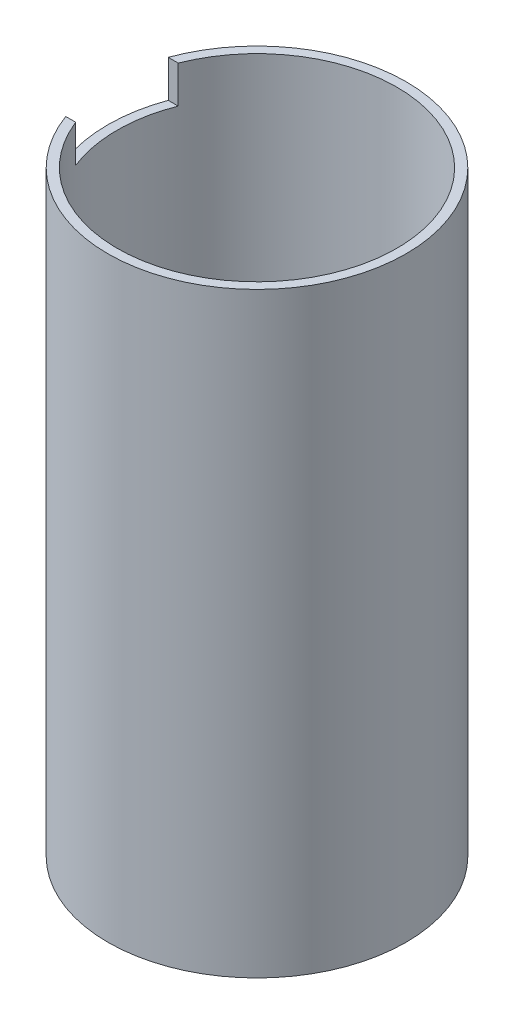
ISO-10303-21;
HEADER;
FILE_DESCRIPTION(('STEP AP214'),'2;1');
FILE_NAME('part.step','',(''),(''),'','','');
FILE_SCHEMA(('AUTOMOTIVE_DESIGN { 1 0 10303 214 1 1 1 1 }'));
ENDSEC;
DATA;
#1=APPLICATION_CONTEXT('core data for automotive mechanical design processes');
#2=APPLICATION_PROTOCOL_DEFINITION('international standard','automotive_design',2000,#1);
#3=PRODUCT_CONTEXT('',#1,'mechanical');
#4=PRODUCT('Part','Part','',(#3));
#5=PRODUCT_RELATED_PRODUCT_CATEGORY('part','',(#4));
#6=PRODUCT_DEFINITION_FORMATION('','',#4);
#7=PRODUCT_DEFINITION_CONTEXT('part definition',#1,'design');
#8=PRODUCT_DEFINITION('design','',#6,#7);
#9=PRODUCT_DEFINITION_SHAPE('','',#8);
#10=(LENGTH_UNIT() NAMED_UNIT(*) SI_UNIT(.MILLI.,.METRE.));
#11=(NAMED_UNIT(*) PLANE_ANGLE_UNIT() SI_UNIT($,.RADIAN.));
#12=(NAMED_UNIT(*) SI_UNIT($,.STERADIAN.) SOLID_ANGLE_UNIT());
#13=UNCERTAINTY_MEASURE_WITH_UNIT(LENGTH_MEASURE(1.E-05),#10,'distance_accuracy_value','');
#14=(GEOMETRIC_REPRESENTATION_CONTEXT(3) GLOBAL_UNCERTAINTY_ASSIGNED_CONTEXT((#13)) GLOBAL_UNIT_ASSIGNED_CONTEXT((#10,
#11,#12)) REPRESENTATION_CONTEXT('',''));
#15=CARTESIAN_POINT('',(0.,0.,0.));
#16=DIRECTION('',(0.,0.,1.));
#17=DIRECTION('',(1.,0.,0.));
#18=AXIS2_PLACEMENT_3D('',#15,#16,#17);
#19=CARTESIAN_POINT('',(0.,64.,0.));
#20=DIRECTION('',(0.,1.,0.));
#21=DIRECTION('',(0.,0.,1.));
#22=AXIS2_PLACEMENT_3D('',#19,#20,#21);
#23=PLANE('',#22);
#24=DIRECTION('',(1.,0.,0.));
#25=VECTOR('',#24,1.);
#26=CARTESIAN_POINT('',(0.,64.,5.5));
#27=LINE('',#26,#25);
#28=CARTESIAN_POINT('',(-15.0249792013167,64.,5.5));
#29=VERTEX_POINT('',#28);
#30=CARTESIAN_POINT('',(-13.9552857369529,64.,5.5));
#31=VERTEX_POINT('',#30);
#32=EDGE_CURVE('E184',#29,#31,#27,.T.);
#33=ORIENTED_EDGE('',*,*,#32,.F.);
#34=CARTESIAN_POINT('',(0.,64.,0.));
#35=DIRECTION('',(0.,1.,0.));
#36=DIRECTION('',(0.,0.,1.));
#37=AXIS2_PLACEMENT_3D('',#34,#35,#36);
#38=CIRCLE('',#37,16.);
#39=CARTESIAN_POINT('',(-15.0249792013167,64.,-5.5));
#40=VERTEX_POINT('',#39);
#41=EDGE_CURVE('E136',#29,#40,#38,.T.);
#42=ORIENTED_EDGE('',*,*,#41,.T.);
#43=DIRECTION('',(-1.,0.,0.));
#44=VECTOR('',#43,1.);
#45=CARTESIAN_POINT('',(-16.8101625802274,64.,-5.5));
#46=LINE('',#45,#44);
#47=CARTESIAN_POINT('',(-13.9552857369529,64.,-5.5));
#48=VERTEX_POINT('',#47);
#49=EDGE_CURVE('E118',#48,#40,#46,.T.);
#50=ORIENTED_EDGE('',*,*,#49,.F.);
#51=CARTESIAN_POINT('',(0.,64.,0.));
#52=DIRECTION('',(0.,1.,0.));
#53=DIRECTION('',(0.,0.,1.));
#54=AXIS2_PLACEMENT_3D('',#51,#52,#53);
#55=CIRCLE('',#54,15.);
#56=EDGE_CURVE('E137',#31,#48,#55,.T.);
#57=ORIENTED_EDGE('',*,*,#56,.F.);
#58=EDGE_LOOP('',(#33,#42,#50,#57));
#59=FACE_BOUND('',#58,.T.);
#60=ADVANCED_FACE('F45',(#59),#23,.T.);
#61=CARTESIAN_POINT('',(0.,0.,0.));
#62=DIRECTION('',(0.,1.,0.));
#63=DIRECTION('',(0.,0.,1.));
#64=AXIS2_PLACEMENT_3D('',#61,#62,#63);
#65=PLANE('',#64);
#66=CARTESIAN_POINT('',(0.,0.,0.));
#67=DIRECTION('',(0.,1.,0.));
#68=DIRECTION('',(0.,0.,1.));
#69=AXIS2_PLACEMENT_3D('',#66,#67,#68);
#70=CIRCLE('',#69,15.);
#71=CARTESIAN_POINT('',(-13.9552857369529,0.,5.5));
#72=VERTEX_POINT('',#71);
#73=CARTESIAN_POINT('',(-13.9552857369529,0.,-5.5));
#74=VERTEX_POINT('',#73);
#75=EDGE_CURVE('E128',#72,#74,#70,.T.);
#76=ORIENTED_EDGE('',*,*,#75,.T.);
#77=DIRECTION('',(1.,0.,0.));
#78=VECTOR('',#77,1.);
#79=CARTESIAN_POINT('',(0.,0.,-5.5));
#80=LINE('',#79,#78);
#81=CARTESIAN_POINT('',(-15.0249792013167,0.,-5.5));
#82=VERTEX_POINT('',#81);
#83=EDGE_CURVE('E112',#82,#74,#80,.T.);
#84=ORIENTED_EDGE('',*,*,#83,.F.);
#85=CARTESIAN_POINT('',(0.,0.,0.));
#86=DIRECTION('',(0.,1.,0.));
#87=DIRECTION('',(0.,0.,1.));
#88=AXIS2_PLACEMENT_3D('',#85,#86,#87);
#89=CIRCLE('',#88,16.);
#90=CARTESIAN_POINT('',(-15.0249792013167,0.,5.5));
#91=VERTEX_POINT('',#90);
#92=EDGE_CURVE('E126',#91,#82,#89,.T.);
#93=ORIENTED_EDGE('',*,*,#92,.F.);
#94=DIRECTION('',(-1.,0.,0.));
#95=VECTOR('',#94,1.);
#96=CARTESIAN_POINT('',(-17.0114058037553,0.,5.5));
#97=LINE('',#96,#95);
#98=EDGE_CURVE('E131',#72,#91,#97,.T.);
#99=ORIENTED_EDGE('',*,*,#98,.F.);
#100=EDGE_LOOP('',(#76,#84,#93,#99));
#101=FACE_BOUND('',#100,.T.);
#102=ADVANCED_FACE('F124',(#101),#65,.F.);
#103=CARTESIAN_POINT('',(0.,64.,0.));
#104=DIRECTION('',(0.,-1.,0.));
#105=DIRECTION('',(0.,0.,-1.));
#106=AXIS2_PLACEMENT_3D('',#103,#104,#105);
#107=CYLINDRICAL_SURFACE('',#106,16.);
#108=ORIENTED_EDGE('',*,*,#92,.T.);
#109=DIRECTION('',(0.,-1.,0.));
#110=VECTOR('',#109,1.);
#111=CARTESIAN_POINT('',(-15.0249792013167,64.,-5.5));
#112=LINE('',#111,#110);
#113=CARTESIAN_POINT('',(-15.0249792013167,4.,-5.5));
#114=VERTEX_POINT('',#113);
#115=EDGE_CURVE('E109',#82,#114,#112,.F.);
#116=ORIENTED_EDGE('',*,*,#115,.T.);
#117=CARTESIAN_POINT('',(0.,4.,0.));
#118=DIRECTION('',(0.,1.,0.));
#119=DIRECTION('',(0.,0.,1.));
#120=AXIS2_PLACEMENT_3D('',#117,#118,#119);
#121=CIRCLE('',#120,16.);
#122=CARTESIAN_POINT('',(-15.0249792013167,4.,5.5));
#123=VERTEX_POINT('',#122);
#124=EDGE_CURVE('E197',#114,#123,#121,.T.);
#125=ORIENTED_EDGE('',*,*,#124,.T.);
#126=DIRECTION('',(0.,-1.,0.));
#127=VECTOR('',#126,1.);
#128=CARTESIAN_POINT('',(-15.0249792013167,64.,5.5));
#129=LINE('',#128,#127);
#130=EDGE_CURVE('E119',#123,#91,#129,.T.);
#131=ORIENTED_EDGE('',*,*,#130,.T.);
#132=EDGE_LOOP('',(#108,#116,#125,#131));
#133=FACE_BOUND('',#132,.T.);
#134=ORIENTED_EDGE('',*,*,#41,.F.);
#135=DIRECTION('',(0.,-1.,0.));
#136=VECTOR('',#135,1.);
#137=CARTESIAN_POINT('',(-15.0249792013167,64.,5.5));
#138=LINE('',#137,#136);
#139=CARTESIAN_POINT('',(-15.0249792013167,60.,5.5));
#140=VERTEX_POINT('',#139);
#141=EDGE_CURVE('E171',#29,#140,#138,.T.);
#142=ORIENTED_EDGE('',*,*,#141,.T.);
#143=CARTESIAN_POINT('',(0.,60.,0.));
#144=DIRECTION('',(0.,-1.,0.));
#145=DIRECTION('',(0.,0.,-1.));
#146=AXIS2_PLACEMENT_3D('',#143,#144,#145);
#147=CIRCLE('',#146,16.);
#148=CARTESIAN_POINT('',(-15.0249792013167,60.,-5.5));
#149=VERTEX_POINT('',#148);
#150=EDGE_CURVE('E180',#140,#149,#147,.T.);
#151=ORIENTED_EDGE('',*,*,#150,.T.);
#152=DIRECTION('',(0.,-1.,0.));
#153=VECTOR('',#152,1.);
#154=CARTESIAN_POINT('',(-15.0249792013167,64.,-5.5));
#155=LINE('',#154,#153);
#156=EDGE_CURVE('E174',#149,#40,#155,.F.);
#157=ORIENTED_EDGE('',*,*,#156,.T.);
#158=EDGE_LOOP('',(#134,#142,#151,#157));
#159=FACE_BOUND('',#158,.T.);
#160=ADVANCED_FACE('F47',(#133,#159),#107,.T.);
#161=CARTESIAN_POINT('',(0.,64.,0.));
#162=DIRECTION('',(0.,-1.,0.));
#163=DIRECTION('',(0.,0.,-1.));
#164=AXIS2_PLACEMENT_3D('',#161,#162,#163);
#165=CYLINDRICAL_SURFACE('',#164,15.);
#166=DIRECTION('',(0.,-1.,0.));
#167=VECTOR('',#166,1.);
#168=CARTESIAN_POINT('',(-13.9552857369529,64.,-5.5));
#169=LINE('',#168,#167);
#170=CARTESIAN_POINT('',(-13.9552857369529,4.,-5.5));
#171=VERTEX_POINT('',#170);
#172=EDGE_CURVE('E11',#74,#171,#169,.F.);
#173=ORIENTED_EDGE('',*,*,#172,.F.);
#174=ORIENTED_EDGE('',*,*,#75,.F.);
#175=DIRECTION('',(0.,-1.,0.));
#176=VECTOR('',#175,1.);
#177=CARTESIAN_POINT('',(-13.9552857369529,64.,5.5));
#178=LINE('',#177,#176);
#179=CARTESIAN_POINT('',(-13.9552857369529,4.,5.5));
#180=VERTEX_POINT('',#179);
#181=EDGE_CURVE('E54',#180,#72,#178,.T.);
#182=ORIENTED_EDGE('',*,*,#181,.F.);
#183=CARTESIAN_POINT('',(0.,4.,0.));
#184=DIRECTION('',(0.,1.,0.));
#185=DIRECTION('',(0.,0.,1.));
#186=AXIS2_PLACEMENT_3D('',#183,#184,#185);
#187=CIRCLE('',#186,15.);
#188=EDGE_CURVE('E156',#171,#180,#187,.T.);
#189=ORIENTED_EDGE('',*,*,#188,.F.);
#190=EDGE_LOOP('',(#173,#174,#182,#189));
#191=FACE_BOUND('',#190,.T.);
#192=DIRECTION('',(0.,-1.,0.));
#193=VECTOR('',#192,1.);
#194=CARTESIAN_POINT('',(-13.9552857369529,64.,5.5));
#195=LINE('',#194,#193);
#196=CARTESIAN_POINT('',(-13.9552857369529,60.,5.5));
#197=VERTEX_POINT('',#196);
#198=EDGE_CURVE('E153',#31,#197,#195,.T.);
#199=ORIENTED_EDGE('',*,*,#198,.F.);
#200=ORIENTED_EDGE('',*,*,#56,.T.);
#201=DIRECTION('',(0.,-1.,0.));
#202=VECTOR('',#201,1.);
#203=CARTESIAN_POINT('',(-13.9552857369529,64.,-5.5));
#204=LINE('',#203,#202);
#205=CARTESIAN_POINT('',(-13.9552857369529,60.,-5.5));
#206=VERTEX_POINT('',#205);
#207=EDGE_CURVE('E150',#206,#48,#204,.F.);
#208=ORIENTED_EDGE('',*,*,#207,.F.);
#209=CARTESIAN_POINT('',(0.,60.,0.));
#210=DIRECTION('',(0.,-1.,0.));
#211=DIRECTION('',(0.,0.,-1.));
#212=AXIS2_PLACEMENT_3D('',#209,#210,#211);
#213=CIRCLE('',#212,15.);
#214=EDGE_CURVE('E142',#197,#206,#213,.T.);
#215=ORIENTED_EDGE('',*,*,#214,.F.);
#216=EDGE_LOOP('',(#199,#200,#208,#215));
#217=FACE_BOUND('',#216,.T.);
#218=ADVANCED_FACE('F168',(#191,#217),#165,.F.);
#219=CARTESIAN_POINT('',(0.,60.,5.5));
#220=DIRECTION('',(0.,0.,1.));
#221=DIRECTION('',(1.,0.,0.));
#222=AXIS2_PLACEMENT_3D('',#219,#220,#221);
#223=PLANE('',#222);
#224=ORIENTED_EDGE('',*,*,#32,.T.);
#225=ORIENTED_EDGE('',*,*,#198,.T.);
#226=DIRECTION('',(1.,0.,0.));
#227=VECTOR('',#226,1.);
#228=CARTESIAN_POINT('',(0.,60.,5.5));
#229=LINE('',#228,#227);
#230=EDGE_CURVE('E68',#140,#197,#229,.T.);
#231=ORIENTED_EDGE('',*,*,#230,.F.);
#232=ORIENTED_EDGE('',*,*,#141,.F.);
#233=EDGE_LOOP('',(#224,#225,#231,#232));
#234=FACE_BOUND('',#233,.T.);
#235=ADVANCED_FACE('F222',(#234),#223,.F.);
#236=CARTESIAN_POINT('',(-16.8101625802274,60.,-5.5));
#237=DIRECTION('',(0.,0.,-1.));
#238=DIRECTION('',(-1.,0.,0.));
#239=AXIS2_PLACEMENT_3D('',#236,#237,#238);
#240=PLANE('',#239);
#241=DIRECTION('',(-1.,0.,0.));
#242=VECTOR('',#241,1.);
#243=CARTESIAN_POINT('',(-16.8101625802274,60.,-5.5));
#244=LINE('',#243,#242);
#245=EDGE_CURVE('E187',#206,#149,#244,.T.);
#246=ORIENTED_EDGE('',*,*,#245,.F.);
#247=ORIENTED_EDGE('',*,*,#207,.T.);
#248=ORIENTED_EDGE('',*,*,#49,.T.);
#249=ORIENTED_EDGE('',*,*,#156,.F.);
#250=EDGE_LOOP('',(#246,#247,#248,#249));
#251=FACE_BOUND('',#250,.T.);
#252=ADVANCED_FACE('F223',(#251),#240,.F.);
#253=CARTESIAN_POINT('',(0.,60.,0.));
#254=DIRECTION('',(0.,-1.,0.));
#255=DIRECTION('',(0.,0.,-1.));
#256=AXIS2_PLACEMENT_3D('',#253,#254,#255);
#257=PLANE('',#256);
#258=ORIENTED_EDGE('',*,*,#230,.T.);
#259=ORIENTED_EDGE('',*,*,#214,.T.);
#260=ORIENTED_EDGE('',*,*,#245,.T.);
#261=ORIENTED_EDGE('',*,*,#150,.F.);
#262=EDGE_LOOP('',(#258,#259,#260,#261));
#263=FACE_BOUND('',#262,.T.);
#264=ADVANCED_FACE('F226',(#263),#257,.F.);
#265=CARTESIAN_POINT('',(0.,4.,-5.5));
#266=DIRECTION('',(0.,0.,-1.));
#267=DIRECTION('',(-1.,0.,0.));
#268=AXIS2_PLACEMENT_3D('',#265,#266,#267);
#269=PLANE('',#268);
#270=ORIENTED_EDGE('',*,*,#83,.T.);
#271=ORIENTED_EDGE('',*,*,#172,.T.);
#272=DIRECTION('',(1.,0.,0.));
#273=VECTOR('',#272,1.);
#274=CARTESIAN_POINT('',(0.,4.,-5.5));
#275=LINE('',#274,#273);
#276=EDGE_CURVE('E61',#114,#171,#275,.T.);
#277=ORIENTED_EDGE('',*,*,#276,.F.);
#278=ORIENTED_EDGE('',*,*,#115,.F.);
#279=EDGE_LOOP('',(#270,#271,#277,#278));
#280=FACE_BOUND('',#279,.T.);
#281=ADVANCED_FACE('F111',(#280),#269,.F.);
#282=CARTESIAN_POINT('',(-17.0114058037553,4.,5.5));
#283=DIRECTION('',(0.,0.,1.));
#284=DIRECTION('',(1.,0.,0.));
#285=AXIS2_PLACEMENT_3D('',#282,#283,#284);
#286=PLANE('',#285);
#287=DIRECTION('',(-1.,0.,0.));
#288=VECTOR('',#287,1.);
#289=CARTESIAN_POINT('',(-17.0114058037553,4.,5.5));
#290=LINE('',#289,#288);
#291=EDGE_CURVE('E130',#180,#123,#290,.T.);
#292=ORIENTED_EDGE('',*,*,#291,.F.);
#293=ORIENTED_EDGE('',*,*,#181,.T.);
#294=ORIENTED_EDGE('',*,*,#98,.T.);
#295=ORIENTED_EDGE('',*,*,#130,.F.);
#296=EDGE_LOOP('',(#292,#293,#294,#295));
#297=FACE_BOUND('',#296,.T.);
#298=ADVANCED_FACE('F162',(#297),#286,.F.);
#299=CARTESIAN_POINT('',(0.,4.,0.));
#300=DIRECTION('',(0.,1.,0.));
#301=DIRECTION('',(0.,0.,1.));
#302=AXIS2_PLACEMENT_3D('',#299,#300,#301);
#303=PLANE('',#302);
#304=ORIENTED_EDGE('',*,*,#276,.T.);
#305=ORIENTED_EDGE('',*,*,#188,.T.);
#306=ORIENTED_EDGE('',*,*,#291,.T.);
#307=ORIENTED_EDGE('',*,*,#124,.F.);
#308=EDGE_LOOP('',(#304,#305,#306,#307));
#309=FACE_BOUND('',#308,.T.);
#310=ADVANCED_FACE('F203',(#309),#303,.F.);
#311=CLOSED_SHELL('',(#60,#102,#160,#218,#235,#252,#264,#281,#298,#310));
#312=MANIFOLD_SOLID_BREP('B2',#311);
#313=ADVANCED_BREP_SHAPE_REPRESENTATION('',(#18,#312),#14);
#314=SHAPE_DEFINITION_REPRESENTATION(#9,#313);
ENDSEC;
END-ISO-10303-21;
